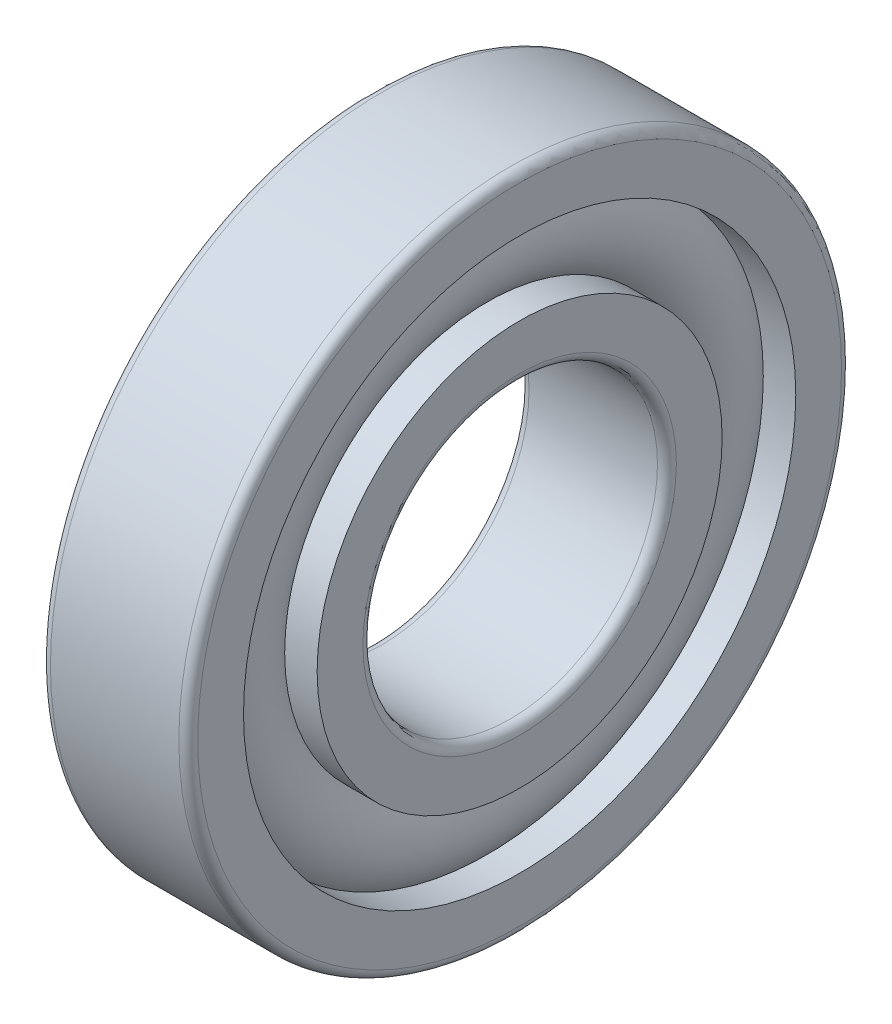
ISO-10303-21;
HEADER;
FILE_DESCRIPTION(('STEP AP214'),'2;1');
FILE_NAME('part.step','',(''),(''),'','','');
FILE_SCHEMA(('AUTOMOTIVE_DESIGN { 1 0 10303 214 1 1 1 1 }'));
ENDSEC;
DATA;
#1=APPLICATION_CONTEXT('core data for automotive mechanical design processes');
#2=APPLICATION_PROTOCOL_DEFINITION('international standard','automotive_design',2000,#1);
#3=PRODUCT_CONTEXT('',#1,'mechanical');
#4=PRODUCT('Part','Part','',(#3));
#5=PRODUCT_RELATED_PRODUCT_CATEGORY('part','',(#4));
#6=PRODUCT_DEFINITION_FORMATION('','',#4);
#7=PRODUCT_DEFINITION_CONTEXT('part definition',#1,'design');
#8=PRODUCT_DEFINITION('design','',#6,#7);
#9=PRODUCT_DEFINITION_SHAPE('','',#8);
#10=(LENGTH_UNIT() NAMED_UNIT(*) SI_UNIT(.MILLI.,.METRE.));
#11=(NAMED_UNIT(*) PLANE_ANGLE_UNIT() SI_UNIT($,.RADIAN.));
#12=(NAMED_UNIT(*) SI_UNIT($,.STERADIAN.) SOLID_ANGLE_UNIT());
#13=UNCERTAINTY_MEASURE_WITH_UNIT(LENGTH_MEASURE(1.E-05),#10,'distance_accuracy_value','');
#14=(GEOMETRIC_REPRESENTATION_CONTEXT(3) GLOBAL_UNCERTAINTY_ASSIGNED_CONTEXT((#13)) GLOBAL_UNIT_ASSIGNED_CONTEXT((#10,
#11,#12)) REPRESENTATION_CONTEXT('',''));
#15=CARTESIAN_POINT('',(0.,0.,0.));
#16=DIRECTION('',(0.,0.,1.));
#17=DIRECTION('',(1.,0.,0.));
#18=AXIS2_PLACEMENT_3D('',#15,#16,#17);
#19=CARTESIAN_POINT('',(0.,0.,0.));
#20=DIRECTION('',(-1.,0.,0.));
#21=DIRECTION('',(0.,0.,1.));
#22=AXIS2_PLACEMENT_3D('',#19,#20,#21);
#23=TOROIDAL_SURFACE('',#22,10.31875,2.38125);
#24=CARTESIAN_POINT('',(1.77487895714045,0.,0.));
#25=DIRECTION('',(-1.,0.,0.));
#26=DIRECTION('',(0.,0.,1.));
#27=AXIS2_PLACEMENT_3D('',#24,#25,#26);
#28=CIRCLE('',#27,11.90625);
#29=CARTESIAN_POINT('',(1.77487895714045,0.,11.90625));
#30=VERTEX_POINT('',#29);
#31=EDGE_CURVE('E35',#30,#30,#28,.F.);
#32=ORIENTED_EDGE('',*,*,#31,.T.);
#33=EDGE_LOOP('',(#32));
#34=FACE_BOUND('',#33,.T.);
#35=CARTESIAN_POINT('',(1.77487895714046,0.,0.));
#36=DIRECTION('',(-1.,0.,0.));
#37=DIRECTION('',(0.,0.,1.));
#38=AXIS2_PLACEMENT_3D('',#35,#36,#37);
#39=CIRCLE('',#38,8.73125);
#40=CARTESIAN_POINT('',(1.77487895714046,0.,8.73125));
#41=VERTEX_POINT('',#40);
#42=EDGE_CURVE('E10',#41,#41,#39,.T.);
#43=ORIENTED_EDGE('',*,*,#42,.T.);
#44=EDGE_LOOP('',(#43));
#45=FACE_BOUND('',#44,.T.);
#46=ADVANCED_FACE('F31',(#34,#45),#23,.T.);
#47=CARTESIAN_POINT('',(-20.6375,0.,0.));
#48=DIRECTION('',(1.,0.,0.));
#49=DIRECTION('',(0.,0.,-1.));
#50=AXIS2_PLACEMENT_3D('',#47,#48,#49);
#51=CYLINDRICAL_SURFACE('',#50,8.73125);
#52=CARTESIAN_POINT('',(3.175,0.,0.));
#53=DIRECTION('',(1.,0.,0.));
#54=DIRECTION('',(0.,0.,-1.));
#55=AXIS2_PLACEMENT_3D('',#52,#53,#54);
#56=CIRCLE('',#55,8.73125);
#57=CARTESIAN_POINT('',(3.175,0.,-8.73125));
#58=VERTEX_POINT('',#57);
#59=EDGE_CURVE('E44',#58,#58,#56,.T.);
#60=ORIENTED_EDGE('',*,*,#59,.F.);
#61=EDGE_LOOP('',(#60));
#62=FACE_BOUND('',#61,.T.);
#63=ORIENTED_EDGE('',*,*,#42,.F.);
#64=EDGE_LOOP('',(#63));
#65=FACE_BOUND('',#64,.T.);
#66=ADVANCED_FACE('F83',(#62,#65),#51,.T.);
#67=CARTESIAN_POINT('',(-20.6375,0.,0.));
#68=DIRECTION('',(1.,0.,0.));
#69=DIRECTION('',(0.,0.,-1.));
#70=AXIS2_PLACEMENT_3D('',#67,#68,#69);
#71=CYLINDRICAL_SURFACE('',#70,8.73125);
#72=CARTESIAN_POINT('',(-3.175,0.,0.));
#73=DIRECTION('',(1.,0.,0.));
#74=DIRECTION('',(0.,0.,-1.));
#75=AXIS2_PLACEMENT_3D('',#72,#73,#74);
#76=CIRCLE('',#75,8.73125);
#77=CARTESIAN_POINT('',(-3.175,0.,-8.73125));
#78=VERTEX_POINT('',#77);
#79=EDGE_CURVE('E53',#78,#78,#76,.T.);
#80=ORIENTED_EDGE('',*,*,#79,.T.);
#81=EDGE_LOOP('',(#80));
#82=FACE_BOUND('',#81,.T.);
#83=CARTESIAN_POINT('',(-1.77487895714046,0.,0.));
#84=DIRECTION('',(1.,0.,0.));
#85=DIRECTION('',(0.,0.,-1.));
#86=AXIS2_PLACEMENT_3D('',#83,#84,#85);
#87=CIRCLE('',#86,8.73125);
#88=CARTESIAN_POINT('',(-1.77487895714046,0.,-8.73125));
#89=VERTEX_POINT('',#88);
#90=EDGE_CURVE('E39',#89,#89,#87,.T.);
#91=ORIENTED_EDGE('',*,*,#90,.F.);
#92=EDGE_LOOP('',(#91));
#93=FACE_BOUND('',#92,.T.);
#94=ADVANCED_FACE('F86',(#82,#93),#71,.T.);
#95=CARTESIAN_POINT('',(3.175,6.7564,0.));
#96=DIRECTION('',(1.,0.,0.));
#97=DIRECTION('',(0.,0.,-1.));
#98=AXIS2_PLACEMENT_3D('',#95,#96,#97);
#99=PLANE('',#98);
#100=ORIENTED_EDGE('',*,*,#59,.T.);
#101=EDGE_LOOP('',(#100));
#102=FACE_BOUND('',#101,.T.);
#103=CARTESIAN_POINT('',(3.175,0.,0.));
#104=DIRECTION('',(1.,0.,0.));
#105=DIRECTION('',(0.,0.,-1.));
#106=AXIS2_PLACEMENT_3D('',#103,#104,#105);
#107=CIRCLE('',#106,6.7564);
#108=CARTESIAN_POINT('',(3.175,0.,-6.7564));
#109=VERTEX_POINT('',#108);
#110=EDGE_CURVE('E75',#109,#109,#107,.T.);
#111=ORIENTED_EDGE('',*,*,#110,.F.);
#112=EDGE_LOOP('',(#111));
#113=FACE_BOUND('',#112,.T.);
#114=ADVANCED_FACE('F80',(#102,#113),#99,.T.);
#115=CARTESIAN_POINT('',(2.7686,0.,0.));
#116=DIRECTION('',(1.,0.,0.));
#117=DIRECTION('',(0.,0.,-1.));
#118=AXIS2_PLACEMENT_3D('',#115,#116,#117);
#119=TOROIDAL_SURFACE('',#118,6.7564,0.4064);
#120=ORIENTED_EDGE('',*,*,#110,.T.);
#121=EDGE_LOOP('',(#120));
#122=FACE_BOUND('',#121,.T.);
#123=CARTESIAN_POINT('',(2.7686,0.,0.));
#124=DIRECTION('',(1.,0.,0.));
#125=DIRECTION('',(0.,0.,-1.));
#126=AXIS2_PLACEMENT_3D('',#123,#124,#125);
#127=CIRCLE('',#126,6.35);
#128=CARTESIAN_POINT('',(2.7686,0.,-6.35));
#129=VERTEX_POINT('',#128);
#130=EDGE_CURVE('E72',#129,#129,#127,.T.);
#131=ORIENTED_EDGE('',*,*,#130,.F.);
#132=EDGE_LOOP('',(#131));
#133=FACE_BOUND('',#132,.T.);
#134=ADVANCED_FACE('F97',(#122,#133),#119,.T.);
#135=CARTESIAN_POINT('',(-20.6375,0.,0.));
#136=DIRECTION('',(1.,0.,0.));
#137=DIRECTION('',(0.,0.,-1.));
#138=AXIS2_PLACEMENT_3D('',#135,#136,#137);
#139=CYLINDRICAL_SURFACE('',#138,6.35);
#140=ORIENTED_EDGE('',*,*,#130,.T.);
#141=EDGE_LOOP('',(#140));
#142=FACE_BOUND('',#141,.T.);
#143=CARTESIAN_POINT('',(-2.7686,0.,0.));
#144=DIRECTION('',(1.,0.,0.));
#145=DIRECTION('',(0.,0.,-1.));
#146=AXIS2_PLACEMENT_3D('',#143,#144,#145);
#147=CIRCLE('',#146,6.35);
#148=CARTESIAN_POINT('',(-2.7686,0.,-6.35));
#149=VERTEX_POINT('',#148);
#150=EDGE_CURVE('E69',#149,#149,#147,.T.);
#151=ORIENTED_EDGE('',*,*,#150,.F.);
#152=EDGE_LOOP('',(#151));
#153=FACE_BOUND('',#152,.T.);
#154=ADVANCED_FACE('F100',(#142,#153),#139,.F.);
#155=CARTESIAN_POINT('',(-2.7686,0.,0.));
#156=DIRECTION('',(1.,0.,0.));
#157=DIRECTION('',(0.,0.,-1.));
#158=AXIS2_PLACEMENT_3D('',#155,#156,#157);
#159=TOROIDAL_SURFACE('',#158,6.7564,0.4064);
#160=ORIENTED_EDGE('',*,*,#150,.T.);
#161=EDGE_LOOP('',(#160));
#162=FACE_BOUND('',#161,.T.);
#163=CARTESIAN_POINT('',(-3.175,0.,0.));
#164=DIRECTION('',(1.,0.,0.));
#165=DIRECTION('',(0.,0.,-1.));
#166=AXIS2_PLACEMENT_3D('',#163,#164,#165);
#167=CIRCLE('',#166,6.7564);
#168=CARTESIAN_POINT('',(-3.175,0.,-6.7564));
#169=VERTEX_POINT('',#168);
#170=EDGE_CURVE('E66',#169,#169,#167,.T.);
#171=ORIENTED_EDGE('',*,*,#170,.F.);
#172=EDGE_LOOP('',(#171));
#173=FACE_BOUND('',#172,.T.);
#174=ADVANCED_FACE('F104',(#162,#173),#159,.T.);
#175=CARTESIAN_POINT('',(-3.175,8.73125,0.));
#176=DIRECTION('',(-1.,0.,0.));
#177=DIRECTION('',(0.,0.,1.));
#178=AXIS2_PLACEMENT_3D('',#175,#176,#177);
#179=PLANE('',#178);
#180=ORIENTED_EDGE('',*,*,#170,.T.);
#181=EDGE_LOOP('',(#180));
#182=FACE_BOUND('',#181,.T.);
#183=ORIENTED_EDGE('',*,*,#79,.F.);
#184=EDGE_LOOP('',(#183));
#185=FACE_BOUND('',#184,.T.);
#186=ADVANCED_FACE('F108',(#182,#185),#179,.T.);
#187=CARTESIAN_POINT('',(-1.77487895714045,0.,0.));
#188=DIRECTION('',(1.,0.,0.));
#189=DIRECTION('',(0.,0.,-1.));
#190=AXIS2_PLACEMENT_3D('',#187,#188,#189);
#191=CIRCLE('',#190,11.90625);
#192=CARTESIAN_POINT('',(-1.77487895714045,0.,-11.90625));
#193=VERTEX_POINT('',#192);
#194=EDGE_CURVE('E47',#193,#193,#191,.F.);
#195=ORIENTED_EDGE('',*,*,#194,.T.);
#196=EDGE_LOOP('',(#195));
#197=FACE_BOUND('',#196,.T.);
#198=ORIENTED_EDGE('',*,*,#90,.T.);
#199=EDGE_LOOP('',(#198));
#200=FACE_BOUND('',#199,.T.);
#201=ADVANCED_FACE('F33',(#197,#200),#23,.T.);
#202=CARTESIAN_POINT('',(-20.6375,0.,0.));
#203=DIRECTION('',(1.,0.,0.));
#204=DIRECTION('',(0.,0.,-1.));
#205=AXIS2_PLACEMENT_3D('',#202,#203,#204);
#206=CYLINDRICAL_SURFACE('',#205,11.90625);
#207=CARTESIAN_POINT('',(3.175,0.,0.));
#208=DIRECTION('',(1.,0.,0.));
#209=DIRECTION('',(0.,0.,-1.));
#210=AXIS2_PLACEMENT_3D('',#207,#208,#209);
#211=CIRCLE('',#210,11.90625);
#212=CARTESIAN_POINT('',(3.175,0.,-11.90625));
#213=VERTEX_POINT('',#212);
#214=EDGE_CURVE('E49',#213,#213,#211,.T.);
#215=ORIENTED_EDGE('',*,*,#214,.T.);
#216=EDGE_LOOP('',(#215));
#217=FACE_BOUND('',#216,.T.);
#218=ORIENTED_EDGE('',*,*,#31,.F.);
#219=EDGE_LOOP('',(#218));
#220=FACE_BOUND('',#219,.T.);
#221=ADVANCED_FACE('F113',(#217,#220),#206,.F.);
#222=CARTESIAN_POINT('',(-20.6375,0.,0.));
#223=DIRECTION('',(1.,0.,0.));
#224=DIRECTION('',(0.,0.,-1.));
#225=AXIS2_PLACEMENT_3D('',#222,#223,#224);
#226=CYLINDRICAL_SURFACE('',#225,11.90625);
#227=CARTESIAN_POINT('',(-3.175,0.,0.));
#228=DIRECTION('',(1.,0.,0.));
#229=DIRECTION('',(0.,0.,-1.));
#230=AXIS2_PLACEMENT_3D('',#227,#228,#229);
#231=CIRCLE('',#230,11.90625);
#232=CARTESIAN_POINT('',(-3.175,0.,-11.90625));
#233=VERTEX_POINT('',#232);
#234=EDGE_CURVE('E144',#233,#233,#231,.T.);
#235=ORIENTED_EDGE('',*,*,#234,.F.);
#236=EDGE_LOOP('',(#235));
#237=FACE_BOUND('',#236,.T.);
#238=ORIENTED_EDGE('',*,*,#194,.F.);
#239=EDGE_LOOP('',(#238));
#240=FACE_BOUND('',#239,.T.);
#241=ADVANCED_FACE('F116',(#237,#240),#226,.F.);
#242=CARTESIAN_POINT('',(3.175,13.8811,0.));
#243=DIRECTION('',(1.,0.,0.));
#244=DIRECTION('',(0.,0.,-1.));
#245=AXIS2_PLACEMENT_3D('',#242,#243,#244);
#246=PLANE('',#245);
#247=CARTESIAN_POINT('',(3.175,0.,0.));
#248=DIRECTION('',(1.,0.,0.));
#249=DIRECTION('',(0.,0.,-1.));
#250=AXIS2_PLACEMENT_3D('',#247,#248,#249);
#251=CIRCLE('',#250,13.8811);
#252=CARTESIAN_POINT('',(3.175,0.,-13.8811));
#253=VERTEX_POINT('',#252);
#254=EDGE_CURVE('E55',#253,#253,#251,.T.);
#255=ORIENTED_EDGE('',*,*,#254,.T.);
#256=EDGE_LOOP('',(#255));
#257=FACE_BOUND('',#256,.T.);
#258=ORIENTED_EDGE('',*,*,#214,.F.);
#259=EDGE_LOOP('',(#258));
#260=FACE_BOUND('',#259,.T.);
#261=ADVANCED_FACE('F117',(#257,#260),#246,.T.);
#262=CARTESIAN_POINT('',(2.7686,0.,0.));
#263=DIRECTION('',(1.,0.,0.));
#264=DIRECTION('',(0.,0.,-1.));
#265=AXIS2_PLACEMENT_3D('',#262,#263,#264);
#266=TOROIDAL_SURFACE('',#265,13.8811,0.4064);
#267=CARTESIAN_POINT('',(2.7686,0.,0.));
#268=DIRECTION('',(1.,0.,0.));
#269=DIRECTION('',(0.,0.,-1.));
#270=AXIS2_PLACEMENT_3D('',#267,#268,#269);
#271=CIRCLE('',#270,14.2875);
#272=CARTESIAN_POINT('',(2.7686,0.,-14.2875));
#273=VERTEX_POINT('',#272);
#274=EDGE_CURVE('E60',#273,#273,#271,.T.);
#275=ORIENTED_EDGE('',*,*,#274,.T.);
#276=EDGE_LOOP('',(#275));
#277=FACE_BOUND('',#276,.T.);
#278=ORIENTED_EDGE('',*,*,#254,.F.);
#279=EDGE_LOOP('',(#278));
#280=FACE_BOUND('',#279,.T.);
#281=ADVANCED_FACE('F120',(#277,#280),#266,.T.);
#282=CARTESIAN_POINT('',(-20.6375,0.,0.));
#283=DIRECTION('',(1.,0.,0.));
#284=DIRECTION('',(0.,0.,-1.));
#285=AXIS2_PLACEMENT_3D('',#282,#283,#284);
#286=CYLINDRICAL_SURFACE('',#285,14.2875);
#287=CARTESIAN_POINT('',(-2.7686,0.,0.));
#288=DIRECTION('',(1.,0.,0.));
#289=DIRECTION('',(0.,0.,-1.));
#290=AXIS2_PLACEMENT_3D('',#287,#288,#289);
#291=CIRCLE('',#290,14.2875);
#292=CARTESIAN_POINT('',(-2.7686,0.,-14.2875));
#293=VERTEX_POINT('',#292);
#294=EDGE_CURVE('E148',#293,#293,#291,.T.);
#295=ORIENTED_EDGE('',*,*,#294,.T.);
#296=EDGE_LOOP('',(#295));
#297=FACE_BOUND('',#296,.T.);
#298=ORIENTED_EDGE('',*,*,#274,.F.);
#299=EDGE_LOOP('',(#298));
#300=FACE_BOUND('',#299,.T.);
#301=ADVANCED_FACE('F124',(#297,#300),#286,.T.);
#302=CARTESIAN_POINT('',(-2.7686,0.,0.));
#303=DIRECTION('',(1.,0.,0.));
#304=DIRECTION('',(0.,0.,-1.));
#305=AXIS2_PLACEMENT_3D('',#302,#303,#304);
#306=TOROIDAL_SURFACE('',#305,13.8811,0.4064);
#307=CARTESIAN_POINT('',(-3.175,0.,0.));
#308=DIRECTION('',(1.,0.,0.));
#309=DIRECTION('',(0.,0.,-1.));
#310=AXIS2_PLACEMENT_3D('',#307,#308,#309);
#311=CIRCLE('',#310,13.8811);
#312=CARTESIAN_POINT('',(-3.175,0.,-13.8811));
#313=VERTEX_POINT('',#312);
#314=EDGE_CURVE('E145',#313,#313,#311,.T.);
#315=ORIENTED_EDGE('',*,*,#314,.T.);
#316=EDGE_LOOP('',(#315));
#317=FACE_BOUND('',#316,.T.);
#318=ORIENTED_EDGE('',*,*,#294,.F.);
#319=EDGE_LOOP('',(#318));
#320=FACE_BOUND('',#319,.T.);
#321=ADVANCED_FACE('F128',(#317,#320),#306,.T.);
#322=CARTESIAN_POINT('',(-3.175,11.90625,0.));
#323=DIRECTION('',(-1.,0.,0.));
#324=DIRECTION('',(0.,0.,1.));
#325=AXIS2_PLACEMENT_3D('',#322,#323,#324);
#326=PLANE('',#325);
#327=ORIENTED_EDGE('',*,*,#234,.T.);
#328=EDGE_LOOP('',(#327));
#329=FACE_BOUND('',#328,.T.);
#330=ORIENTED_EDGE('',*,*,#314,.F.);
#331=EDGE_LOOP('',(#330));
#332=FACE_BOUND('',#331,.T.);
#333=ADVANCED_FACE('F132',(#329,#332),#326,.T.);
#334=CLOSED_SHELL('',(#46,#66,#94,#114,#134,#154,#174,#186,#201,#221,#241,#261,#281,#301,#321,#333));
#335=MANIFOLD_SOLID_BREP('B2',#334);
#336=ADVANCED_BREP_SHAPE_REPRESENTATION('',(#18,#335),#14);
#337=SHAPE_DEFINITION_REPRESENTATION(#9,#336);
ENDSEC;
END-ISO-10303-21;
